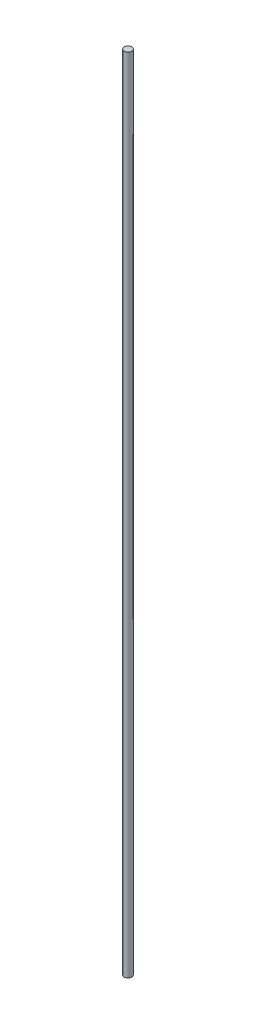
ISO-10303-21;
HEADER;
FILE_DESCRIPTION(('STEP AP214'),'2;1');
FILE_NAME('part.step','',(''),(''),'','','');
FILE_SCHEMA(('AUTOMOTIVE_DESIGN { 1 0 10303 214 1 1 1 1 }'));
ENDSEC;
DATA;
#1=APPLICATION_CONTEXT('core data for automotive mechanical design processes');
#2=APPLICATION_PROTOCOL_DEFINITION('international standard','automotive_design',2000,#1);
#3=PRODUCT_CONTEXT('',#1,'mechanical');
#4=PRODUCT('Part','Part','',(#3));
#5=PRODUCT_RELATED_PRODUCT_CATEGORY('part','',(#4));
#6=PRODUCT_DEFINITION_FORMATION('','',#4);
#7=PRODUCT_DEFINITION_CONTEXT('part definition',#1,'design');
#8=PRODUCT_DEFINITION('design','',#6,#7);
#9=PRODUCT_DEFINITION_SHAPE('','',#8);
#10=(LENGTH_UNIT() NAMED_UNIT(*) SI_UNIT(.MILLI.,.METRE.));
#11=(NAMED_UNIT(*) PLANE_ANGLE_UNIT() SI_UNIT($,.RADIAN.));
#12=(NAMED_UNIT(*) SI_UNIT($,.STERADIAN.) SOLID_ANGLE_UNIT());
#13=UNCERTAINTY_MEASURE_WITH_UNIT(LENGTH_MEASURE(1.E-05),#10,'distance_accuracy_value','');
#14=(GEOMETRIC_REPRESENTATION_CONTEXT(3) GLOBAL_UNCERTAINTY_ASSIGNED_CONTEXT((#13)) GLOBAL_UNIT_ASSIGNED_CONTEXT((#10,
#11,#12)) REPRESENTATION_CONTEXT('',''));
#15=CARTESIAN_POINT('',(0.,0.,0.));
#16=DIRECTION('',(0.,0.,1.));
#17=DIRECTION('',(1.,0.,0.));
#18=AXIS2_PLACEMENT_3D('',#15,#16,#17);
#19=CARTESIAN_POINT('',(0.,320.,0.));
#20=DIRECTION('',(0.,-1.,0.));
#21=DIRECTION('',(0.,0.,-1.));
#22=AXIS2_PLACEMENT_3D('',#19,#20,#21);
#23=CYLINDRICAL_SURFACE('',#22,1.5);
#24=CARTESIAN_POINT('',(0.,320.,0.));
#25=DIRECTION('',(0.,1.,0.));
#26=DIRECTION('',(0.,0.,1.));
#27=AXIS2_PLACEMENT_3D('',#24,#25,#26);
#28=CIRCLE('',#27,1.5);
#29=CARTESIAN_POINT('',(0.,320.,1.5));
#30=VERTEX_POINT('',#29);
#31=EDGE_CURVE('E10',#30,#30,#28,.T.);
#32=ORIENTED_EDGE('',*,*,#31,.F.);
#33=EDGE_LOOP('',(#32));
#34=FACE_BOUND('',#33,.T.);
#35=CARTESIAN_POINT('',(0.,0.,0.));
#36=DIRECTION('',(0.,1.,0.));
#37=DIRECTION('',(0.,0.,1.));
#38=AXIS2_PLACEMENT_3D('',#35,#36,#37);
#39=CIRCLE('',#38,1.5);
#40=CARTESIAN_POINT('',(0.,0.,1.5));
#41=VERTEX_POINT('',#40);
#42=EDGE_CURVE('E35',#41,#41,#39,.T.);
#43=ORIENTED_EDGE('',*,*,#42,.T.);
#44=EDGE_LOOP('',(#43));
#45=FACE_BOUND('',#44,.T.);
#46=ADVANCED_FACE('F29',(#34,#45),#23,.T.);
#47=CARTESIAN_POINT('',(0.,320.,0.));
#48=DIRECTION('',(0.,1.,0.));
#49=DIRECTION('',(0.,0.,1.));
#50=AXIS2_PLACEMENT_3D('',#47,#48,#49);
#51=PLANE('',#50);
#52=ORIENTED_EDGE('',*,*,#31,.T.);
#53=EDGE_LOOP('',(#52));
#54=FACE_BOUND('',#53,.T.);
#55=ADVANCED_FACE('F44',(#54),#51,.T.);
#56=CARTESIAN_POINT('',(0.,0.,0.));
#57=DIRECTION('',(0.,1.,0.));
#58=DIRECTION('',(0.,0.,1.));
#59=AXIS2_PLACEMENT_3D('',#56,#57,#58);
#60=PLANE('',#59);
#61=ORIENTED_EDGE('',*,*,#42,.F.);
#62=EDGE_LOOP('',(#61));
#63=FACE_BOUND('',#62,.T.);
#64=ADVANCED_FACE('F42',(#63),#60,.F.);
#65=CLOSED_SHELL('',(#46,#55,#64));
#66=MANIFOLD_SOLID_BREP('B2',#65);
#67=ADVANCED_BREP_SHAPE_REPRESENTATION('',(#18,#66),#14);
#68=SHAPE_DEFINITION_REPRESENTATION(#9,#67);
ENDSEC;
END-ISO-10303-21;
